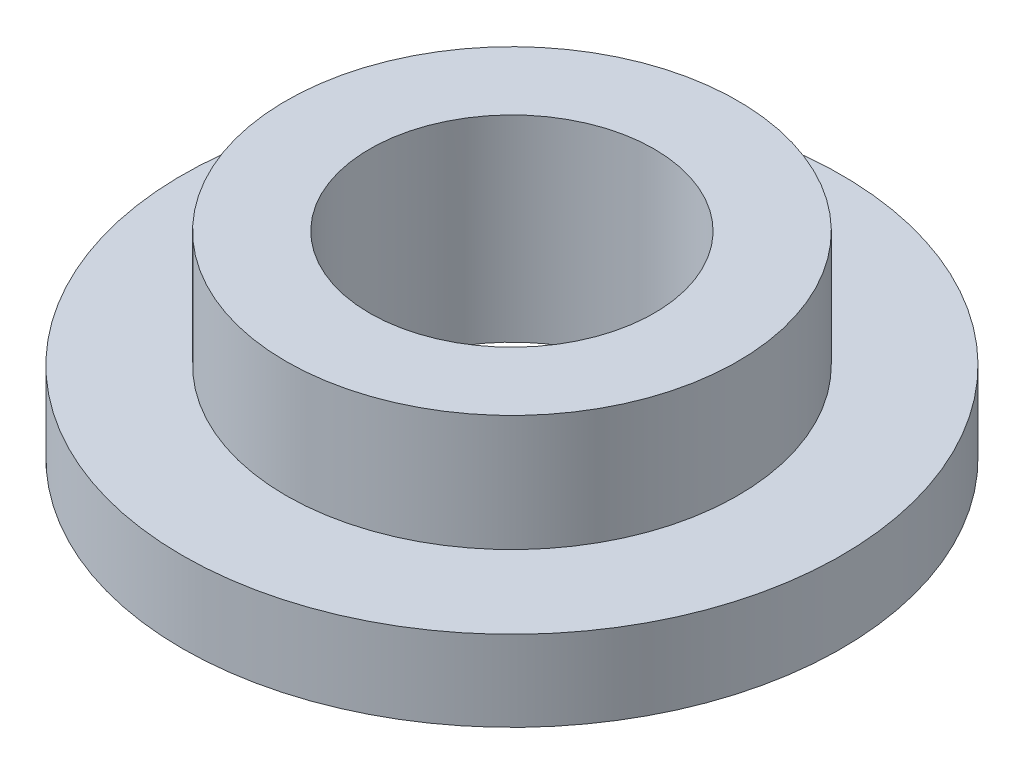
ISO-10303-21;
HEADER;
FILE_DESCRIPTION(('STEP AP214'),'2;1');
FILE_NAME('part.step','',(''),(''),'','','');
FILE_SCHEMA(('AUTOMOTIVE_DESIGN { 1 0 10303 214 1 1 1 1 }'));
ENDSEC;
DATA;
#1=APPLICATION_CONTEXT('core data for automotive mechanical design processes');
#2=APPLICATION_PROTOCOL_DEFINITION('international standard','automotive_design',2000,#1);
#3=PRODUCT_CONTEXT('',#1,'mechanical');
#4=PRODUCT('Part','Part','',(#3));
#5=PRODUCT_RELATED_PRODUCT_CATEGORY('part','',(#4));
#6=PRODUCT_DEFINITION_FORMATION('','',#4);
#7=PRODUCT_DEFINITION_CONTEXT('part definition',#1,'design');
#8=PRODUCT_DEFINITION('design','',#6,#7);
#9=PRODUCT_DEFINITION_SHAPE('','',#8);
#10=(LENGTH_UNIT() NAMED_UNIT(*) SI_UNIT(.MILLI.,.METRE.));
#11=(NAMED_UNIT(*) PLANE_ANGLE_UNIT() SI_UNIT($,.RADIAN.));
#12=(NAMED_UNIT(*) SI_UNIT($,.STERADIAN.) SOLID_ANGLE_UNIT());
#13=UNCERTAINTY_MEASURE_WITH_UNIT(LENGTH_MEASURE(1.E-05),#10,'distance_accuracy_value','');
#14=(GEOMETRIC_REPRESENTATION_CONTEXT(3) GLOBAL_UNCERTAINTY_ASSIGNED_CONTEXT((#13)) GLOBAL_UNIT_ASSIGNED_CONTEXT((#10,
#11,#12)) REPRESENTATION_CONTEXT('',''));
#15=CARTESIAN_POINT('',(0.,0.,0.));
#16=DIRECTION('',(0.,0.,1.));
#17=DIRECTION('',(1.,0.,0.));
#18=AXIS2_PLACEMENT_3D('',#15,#16,#17);
#19=CARTESIAN_POINT('',(0.,3.4,0.));
#20=DIRECTION('',(0.,-1.,0.));
#21=DIRECTION('',(0.,0.,-1.));
#22=AXIS2_PLACEMENT_3D('',#19,#20,#21);
#23=CYLINDRICAL_SURFACE('',#22,13.9);
#24=CARTESIAN_POINT('',(0.,3.4,0.));
#25=DIRECTION('',(0.,1.,0.));
#26=DIRECTION('',(0.,0.,1.));
#27=AXIS2_PLACEMENT_3D('',#24,#25,#26);
#28=CIRCLE('',#27,13.9);
#29=CARTESIAN_POINT('',(0.,3.4,13.9));
#30=VERTEX_POINT('',#29);
#31=EDGE_CURVE('E47',#30,#30,#28,.T.);
#32=ORIENTED_EDGE('',*,*,#31,.F.);
#33=EDGE_LOOP('',(#32));
#34=FACE_BOUND('',#33,.T.);
#35=CARTESIAN_POINT('',(0.,0.,0.));
#36=DIRECTION('',(0.,1.,0.));
#37=DIRECTION('',(0.,0.,1.));
#38=AXIS2_PLACEMENT_3D('',#35,#36,#37);
#39=CIRCLE('',#38,13.9);
#40=CARTESIAN_POINT('',(0.,0.,13.9));
#41=VERTEX_POINT('',#40);
#42=EDGE_CURVE('E42',#41,#41,#39,.T.);
#43=ORIENTED_EDGE('',*,*,#42,.T.);
#44=EDGE_LOOP('',(#43));
#45=FACE_BOUND('',#44,.T.);
#46=ADVANCED_FACE('F39',(#34,#45),#23,.T.);
#47=CARTESIAN_POINT('',(0.,3.4,0.));
#48=DIRECTION('',(0.,1.,0.));
#49=DIRECTION('',(0.,0.,1.));
#50=AXIS2_PLACEMENT_3D('',#47,#48,#49);
#51=PLANE('',#50);
#52=CARTESIAN_POINT('',(0.,3.4,0.));
#53=DIRECTION('',(0.,1.,0.));
#54=DIRECTION('',(0.,0.,1.));
#55=AXIS2_PLACEMENT_3D('',#52,#53,#54);
#56=CIRCLE('',#55,9.525);
#57=CARTESIAN_POINT('',(0.,3.4,9.525));
#58=VERTEX_POINT('',#57);
#59=EDGE_CURVE('E10',#58,#58,#56,.T.);
#60=ORIENTED_EDGE('',*,*,#59,.F.);
#61=EDGE_LOOP('',(#60));
#62=FACE_BOUND('',#61,.T.);
#63=ORIENTED_EDGE('',*,*,#31,.T.);
#64=EDGE_LOOP('',(#63));
#65=FACE_BOUND('',#64,.T.);
#66=ADVANCED_FACE('F74',(#62,#65),#51,.T.);
#67=CARTESIAN_POINT('',(0.,0.,0.));
#68=DIRECTION('',(0.,1.,0.));
#69=DIRECTION('',(0.,0.,1.));
#70=AXIS2_PLACEMENT_3D('',#67,#68,#69);
#71=PLANE('',#70);
#72=CARTESIAN_POINT('',(0.,0.,0.));
#73=DIRECTION('',(0.,-1.,0.));
#74=DIRECTION('',(0.,0.,-1.));
#75=AXIS2_PLACEMENT_3D('',#72,#73,#74);
#76=CIRCLE('',#75,6.);
#77=CARTESIAN_POINT('',(0.,0.,-6.));
#78=VERTEX_POINT('',#77);
#79=EDGE_CURVE('E62',#78,#78,#76,.T.);
#80=ORIENTED_EDGE('',*,*,#79,.F.);
#81=EDGE_LOOP('',(#80));
#82=FACE_BOUND('',#81,.T.);
#83=ORIENTED_EDGE('',*,*,#42,.F.);
#84=EDGE_LOOP('',(#83));
#85=FACE_BOUND('',#84,.T.);
#86=ADVANCED_FACE('F70',(#82,#85),#71,.F.);
#87=CARTESIAN_POINT('',(0.,8.3,0.));
#88=DIRECTION('',(0.,-1.,0.));
#89=DIRECTION('',(0.,0.,-1.));
#90=AXIS2_PLACEMENT_3D('',#87,#88,#89);
#91=CYLINDRICAL_SURFACE('',#90,9.525);
#92=CARTESIAN_POINT('',(0.,8.3,0.));
#93=DIRECTION('',(0.,1.,0.));
#94=DIRECTION('',(0.,0.,1.));
#95=AXIS2_PLACEMENT_3D('',#92,#93,#94);
#96=CIRCLE('',#95,9.525);
#97=CARTESIAN_POINT('',(0.,8.3,9.525));
#98=VERTEX_POINT('',#97);
#99=EDGE_CURVE('E54',#98,#98,#96,.T.);
#100=ORIENTED_EDGE('',*,*,#99,.F.);
#101=EDGE_LOOP('',(#100));
#102=FACE_BOUND('',#101,.T.);
#103=ORIENTED_EDGE('',*,*,#59,.T.);
#104=EDGE_LOOP('',(#103));
#105=FACE_BOUND('',#104,.T.);
#106=ADVANCED_FACE('F73',(#102,#105),#91,.T.);
#107=CARTESIAN_POINT('',(0.,8.3,0.));
#108=DIRECTION('',(0.,1.,0.));
#109=DIRECTION('',(0.,0.,1.));
#110=AXIS2_PLACEMENT_3D('',#107,#108,#109);
#111=PLANE('',#110);
#112=CARTESIAN_POINT('',(0.,8.3,0.));
#113=DIRECTION('',(0.,1.,0.));
#114=DIRECTION('',(0.,0.,1.));
#115=AXIS2_PLACEMENT_3D('',#112,#113,#114);
#116=CIRCLE('',#115,6.);
#117=CARTESIAN_POINT('',(0.,8.3,6.));
#118=VERTEX_POINT('',#117);
#119=EDGE_CURVE('E58',#118,#118,#116,.F.);
#120=ORIENTED_EDGE('',*,*,#119,.T.);
#121=EDGE_LOOP('',(#120));
#122=FACE_BOUND('',#121,.T.);
#123=ORIENTED_EDGE('',*,*,#99,.T.);
#124=EDGE_LOOP('',(#123));
#125=FACE_BOUND('',#124,.T.);
#126=ADVANCED_FACE('F93',(#122,#125),#111,.T.);
#127=CARTESIAN_POINT('',(0.,25.2705627484771,0.));
#128=DIRECTION('',(0.,-1.,0.));
#129=DIRECTION('',(0.,0.,-1.));
#130=AXIS2_PLACEMENT_3D('',#127,#128,#129);
#131=CYLINDRICAL_SURFACE('',#130,6.);
#132=ORIENTED_EDGE('',*,*,#79,.T.);
#133=EDGE_LOOP('',(#132));
#134=FACE_BOUND('',#133,.T.);
#135=ORIENTED_EDGE('',*,*,#119,.F.);
#136=EDGE_LOOP('',(#135));
#137=FACE_BOUND('',#136,.T.);
#138=ADVANCED_FACE('F67',(#134,#137),#131,.F.);
#139=CLOSED_SHELL('',(#46,#66,#86,#106,#126,#138));
#140=MANIFOLD_SOLID_BREP('B2',#139);
#141=ADVANCED_BREP_SHAPE_REPRESENTATION('',(#18,#140),#14);
#142=SHAPE_DEFINITION_REPRESENTATION(#9,#141);
ENDSEC;
END-ISO-10303-21;
